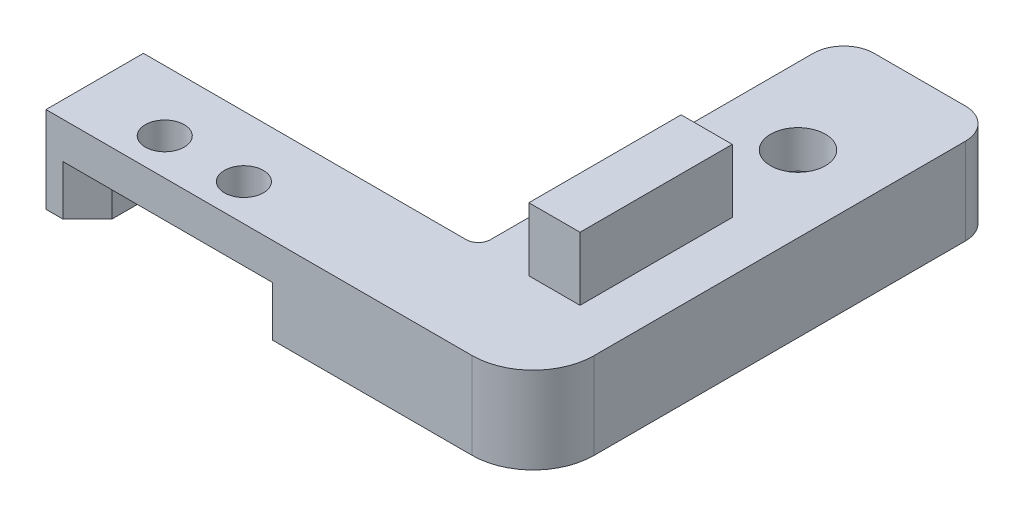
ISO-10303-21;
HEADER;
FILE_DESCRIPTION(('STEP AP214'),'2;1');
FILE_NAME('part.step','',(''),(''),'','','');
FILE_SCHEMA(('AUTOMOTIVE_DESIGN { 1 0 10303 214 1 1 1 1 }'));
ENDSEC;
DATA;
#1=APPLICATION_CONTEXT('core data for automotive mechanical design processes');
#2=APPLICATION_PROTOCOL_DEFINITION('international standard','automotive_design',2000,#1);
#3=PRODUCT_CONTEXT('',#1,'mechanical');
#4=PRODUCT('Part','Part','',(#3));
#5=PRODUCT_RELATED_PRODUCT_CATEGORY('part','',(#4));
#6=PRODUCT_DEFINITION_FORMATION('','',#4);
#7=PRODUCT_DEFINITION_CONTEXT('part definition',#1,'design');
#8=PRODUCT_DEFINITION('design','',#6,#7);
#9=PRODUCT_DEFINITION_SHAPE('','',#8);
#10=(LENGTH_UNIT() NAMED_UNIT(*) SI_UNIT(.MILLI.,.METRE.));
#11=(NAMED_UNIT(*) PLANE_ANGLE_UNIT() SI_UNIT($,.RADIAN.));
#12=(NAMED_UNIT(*) SI_UNIT($,.STERADIAN.) SOLID_ANGLE_UNIT());
#13=UNCERTAINTY_MEASURE_WITH_UNIT(LENGTH_MEASURE(1.E-05),#10,'distance_accuracy_value','');
#14=(GEOMETRIC_REPRESENTATION_CONTEXT(3) GLOBAL_UNCERTAINTY_ASSIGNED_CONTEXT((#13)) GLOBAL_UNIT_ASSIGNED_CONTEXT((#10,
#11,#12)) REPRESENTATION_CONTEXT('',''));
#15=CARTESIAN_POINT('',(0.,0.,0.));
#16=DIRECTION('',(0.,0.,1.));
#17=DIRECTION('',(1.,0.,0.));
#18=AXIS2_PLACEMENT_3D('',#15,#16,#17);
#19=CARTESIAN_POINT('',(0.,0.,0.));
#20=DIRECTION('',(0.,-1.,0.));
#21=DIRECTION('',(0.,0.,-1.));
#22=AXIS2_PLACEMENT_3D('',#19,#20,#21);
#23=PLANE('',#22);
#24=DIRECTION('',(1.,0.,0.));
#25=VECTOR('',#24,1.);
#26=CARTESIAN_POINT('',(0.,0.,38.));
#27=LINE('',#26,#25);
#28=CARTESIAN_POINT('',(-21.4,0.,38.));
#29=VERTEX_POINT('',#28);
#30=CARTESIAN_POINT('',(-4.99999999999999,0.,38.));
#31=VERTEX_POINT('',#30);
#32=EDGE_CURVE('E301',#29,#31,#27,.T.);
#33=ORIENTED_EDGE('',*,*,#32,.F.);
#34=DIRECTION('',(0.707106781186546,0.,0.707106781186549));
#35=VECTOR('',#34,1.);
#36=CARTESIAN_POINT('',(-29.7,0.,29.6999999999999));
#37=LINE('',#36,#35);
#38=CARTESIAN_POINT('',(-23.4,0.,36.));
#39=VERTEX_POINT('',#38);
#40=EDGE_CURVE('E67',#29,#39,#37,.F.);
#41=ORIENTED_EDGE('',*,*,#40,.T.);
#42=DIRECTION('',(0.,0.,1.));
#43=VECTOR('',#42,1.);
#44=CARTESIAN_POINT('',(-23.4,0.,30.));
#45=LINE('',#44,#43);
#46=CARTESIAN_POINT('',(-23.4,0.,30.));
#47=VERTEX_POINT('',#46);
#48=EDGE_CURVE('E210',#47,#39,#45,.T.);
#49=ORIENTED_EDGE('',*,*,#48,.F.);
#50=DIRECTION('',(-1.,0.,0.));
#51=VECTOR('',#50,1.);
#52=CARTESIAN_POINT('',(-12.5,0.,30.));
#53=LINE('',#52,#51);
#54=CARTESIAN_POINT('',(-13.5,0.,30.));
#55=VERTEX_POINT('',#54);
#56=EDGE_CURVE('E296',#55,#47,#53,.T.);
#57=ORIENTED_EDGE('',*,*,#56,.F.);
#58=CARTESIAN_POINT('',(-13.5,0.,29.));
#59=DIRECTION('',(0.,-1.,0.));
#60=DIRECTION('',(0.,0.,-1.));
#61=AXIS2_PLACEMENT_3D('',#58,#59,#60);
#62=CIRCLE('',#61,1.);
#63=CARTESIAN_POINT('',(-12.5,0.,29.));
#64=VERTEX_POINT('',#63);
#65=EDGE_CURVE('E346',#55,#64,#62,.F.);
#66=ORIENTED_EDGE('',*,*,#65,.T.);
#67=DIRECTION('',(0.,0.,1.));
#68=VECTOR('',#67,1.);
#69=CARTESIAN_POINT('',(-12.5,0.,0.));
#70=LINE('',#69,#68);
#71=CARTESIAN_POINT('',(-12.5,0.,2.5));
#72=VERTEX_POINT('',#71);
#73=EDGE_CURVE('E292',#72,#64,#70,.T.);
#74=ORIENTED_EDGE('',*,*,#73,.F.);
#75=CARTESIAN_POINT('',(-10.,0.,2.5));
#76=DIRECTION('',(0.,-1.,0.));
#77=DIRECTION('',(0.,0.,-1.));
#78=AXIS2_PLACEMENT_3D('',#75,#76,#77);
#79=CIRCLE('',#78,2.5);
#80=CARTESIAN_POINT('',(-10.,0.,0.));
#81=VERTEX_POINT('',#80);
#82=EDGE_CURVE('E328',#72,#81,#79,.T.);
#83=ORIENTED_EDGE('',*,*,#82,.T.);
#84=DIRECTION('',(-1.,0.,0.));
#85=VECTOR('',#84,1.);
#86=CARTESIAN_POINT('',(0.,0.,0.));
#87=LINE('',#86,#85);
#88=CARTESIAN_POINT('',(-2.5,0.,0.));
#89=VERTEX_POINT('',#88);
#90=EDGE_CURVE('E289',#89,#81,#87,.T.);
#91=ORIENTED_EDGE('',*,*,#90,.F.);
#92=CARTESIAN_POINT('',(-2.5,0.,2.5));
#93=DIRECTION('',(0.,-1.,0.));
#94=DIRECTION('',(0.,0.,-1.));
#95=AXIS2_PLACEMENT_3D('',#92,#93,#94);
#96=CIRCLE('',#95,2.5);
#97=CARTESIAN_POINT('',(0.,0.,2.5));
#98=VERTEX_POINT('',#97);
#99=EDGE_CURVE('E326',#89,#98,#96,.T.);
#100=ORIENTED_EDGE('',*,*,#99,.T.);
#101=DIRECTION('',(0.,0.,-1.));
#102=VECTOR('',#101,1.);
#103=CARTESIAN_POINT('',(0.,0.,0.));
#104=LINE('',#103,#102);
#105=CARTESIAN_POINT('',(0.,0.,33.));
#106=VERTEX_POINT('',#105);
#107=EDGE_CURVE('E268',#106,#98,#104,.T.);
#108=ORIENTED_EDGE('',*,*,#107,.F.);
#109=CARTESIAN_POINT('',(-5.,0.,33.));
#110=DIRECTION('',(0.,-1.,0.));
#111=DIRECTION('',(0.,0.,-1.));
#112=AXIS2_PLACEMENT_3D('',#109,#110,#111);
#113=CIRCLE('',#112,5.);
#114=EDGE_CURVE('E316',#106,#31,#113,.T.);
#115=ORIENTED_EDGE('',*,*,#114,.T.);
#116=EDGE_LOOP('',(#33,#41,#49,#57,#66,#74,#83,#91,#100,#108,#115));
#117=FACE_BOUND('',#116,.T.);
#118=CARTESIAN_POINT('',(-6.25,0.,10.));
#119=DIRECTION('',(0.,-1.,0.));
#120=DIRECTION('',(0.,0.,-1.));
#121=AXIS2_PLACEMENT_3D('',#118,#119,#120);
#122=CIRCLE('',#121,4.);
#123=CARTESIAN_POINT('',(-6.25,0.,6.));
#124=VERTEX_POINT('',#123);
#125=EDGE_CURVE('E225',#124,#124,#122,.T.);
#126=ORIENTED_EDGE('',*,*,#125,.F.);
#127=EDGE_LOOP('',(#126));
#128=FACE_BOUND('',#127,.T.);
#129=ADVANCED_FACE('F43',(#117,#128),#23,.T.);
#130=CARTESIAN_POINT('',(-33.25,0.,35.));
#131=DIRECTION('',(0.,-1.,0.));
#132=DIRECTION('',(0.,0.,-1.));
#133=AXIS2_PLACEMENT_3D('',#130,#131,#132);
#134=CYLINDRICAL_SURFACE('',#133,1.6);
#135=CARTESIAN_POINT('',(-33.25,7.1,35.));
#136=DIRECTION('',(0.,-1.,0.));
#137=DIRECTION('',(0.,0.,-1.));
#138=AXIS2_PLACEMENT_3D('',#135,#136,#137);
#139=CIRCLE('',#138,1.6);
#140=CARTESIAN_POINT('',(-33.25,7.1,33.4));
#141=VERTEX_POINT('',#140);
#142=EDGE_CURVE('E222',#141,#141,#139,.T.);
#143=ORIENTED_EDGE('',*,*,#142,.F.);
#144=EDGE_LOOP('',(#143));
#145=FACE_BOUND('',#144,.T.);
#146=CARTESIAN_POINT('',(-33.25,4.1,35.));
#147=DIRECTION('',(0.,-1.,0.));
#148=DIRECTION('',(0.,0.,-1.));
#149=AXIS2_PLACEMENT_3D('',#146,#147,#148);
#150=CIRCLE('',#149,1.6);
#151=CARTESIAN_POINT('',(-33.25,4.1,33.4));
#152=VERTEX_POINT('',#151);
#153=EDGE_CURVE('E216',#152,#152,#150,.F.);
#154=ORIENTED_EDGE('',*,*,#153,.F.);
#155=EDGE_LOOP('',(#154));
#156=FACE_BOUND('',#155,.T.);
#157=ADVANCED_FACE('F428',(#145,#156),#134,.F.);
#158=CARTESIAN_POINT('',(-26.75,0.,35.));
#159=DIRECTION('',(0.,-1.,0.));
#160=DIRECTION('',(0.,0.,-1.));
#161=AXIS2_PLACEMENT_3D('',#158,#159,#160);
#162=CYLINDRICAL_SURFACE('',#161,1.6);
#163=CARTESIAN_POINT('',(-26.75,7.1,35.));
#164=DIRECTION('',(0.,-1.,0.));
#165=DIRECTION('',(0.,0.,-1.));
#166=AXIS2_PLACEMENT_3D('',#163,#164,#165);
#167=CIRCLE('',#166,1.6);
#168=CARTESIAN_POINT('',(-26.75,7.1,33.4));
#169=VERTEX_POINT('',#168);
#170=EDGE_CURVE('E219',#169,#169,#167,.T.);
#171=ORIENTED_EDGE('',*,*,#170,.F.);
#172=EDGE_LOOP('',(#171));
#173=FACE_BOUND('',#172,.T.);
#174=CARTESIAN_POINT('',(-26.75,4.1,35.));
#175=DIRECTION('',(0.,-1.,0.));
#176=DIRECTION('',(0.,0.,-1.));
#177=AXIS2_PLACEMENT_3D('',#174,#175,#176);
#178=CIRCLE('',#177,1.6);
#179=CARTESIAN_POINT('',(-26.75,4.1,33.4));
#180=VERTEX_POINT('',#179);
#181=EDGE_CURVE('E214',#180,#180,#178,.F.);
#182=ORIENTED_EDGE('',*,*,#181,.F.);
#183=EDGE_LOOP('',(#182));
#184=FACE_BOUND('',#183,.T.);
#185=ADVANCED_FACE('F435',(#173,#184),#162,.F.);
#186=CARTESIAN_POINT('',(0.,7.1,0.));
#187=DIRECTION('',(0.,-1.,0.));
#188=DIRECTION('',(0.,0.,-1.));
#189=AXIS2_PLACEMENT_3D('',#186,#187,#188);
#190=PLANE('',#189);
#191=ORIENTED_EDGE('',*,*,#170,.T.);
#192=EDGE_LOOP('',(#191));
#193=FACE_BOUND('',#192,.T.);
#194=ORIENTED_EDGE('',*,*,#142,.T.);
#195=EDGE_LOOP('',(#194));
#196=FACE_BOUND('',#195,.T.);
#197=CARTESIAN_POINT('',(-6.25,7.1,10.));
#198=DIRECTION('',(0.,-1.,0.));
#199=DIRECTION('',(0.,0.,-1.));
#200=AXIS2_PLACEMENT_3D('',#197,#198,#199);
#201=CIRCLE('',#200,2.25);
#202=CARTESIAN_POINT('',(-6.25,7.1,7.75));
#203=VERTEX_POINT('',#202);
#204=EDGE_CURVE('E234',#203,#203,#201,.T.);
#205=ORIENTED_EDGE('',*,*,#204,.T.);
#206=EDGE_LOOP('',(#205));
#207=FACE_BOUND('',#206,.T.);
#208=DIRECTION('',(-1.,0.,0.));
#209=VECTOR('',#208,1.);
#210=CARTESIAN_POINT('',(0.,7.1,0.));
#211=LINE('',#210,#209);
#212=CARTESIAN_POINT('',(-2.5,7.1,0.));
#213=VERTEX_POINT('',#212);
#214=CARTESIAN_POINT('',(-10.,7.1,0.));
#215=VERTEX_POINT('',#214);
#216=EDGE_CURVE('E272',#213,#215,#211,.T.);
#217=ORIENTED_EDGE('',*,*,#216,.T.);
#218=CARTESIAN_POINT('',(-10.,7.1,2.5));
#219=DIRECTION('',(0.,-1.,0.));
#220=DIRECTION('',(0.,0.,-1.));
#221=AXIS2_PLACEMENT_3D('',#218,#219,#220);
#222=CIRCLE('',#221,2.5);
#223=CARTESIAN_POINT('',(-12.5,7.1,2.5));
#224=VERTEX_POINT('',#223);
#225=EDGE_CURVE('E337',#215,#224,#222,.F.);
#226=ORIENTED_EDGE('',*,*,#225,.T.);
#227=DIRECTION('',(0.,0.,1.));
#228=VECTOR('',#227,1.);
#229=CARTESIAN_POINT('',(-12.5,7.1,0.));
#230=LINE('',#229,#228);
#231=CARTESIAN_POINT('',(-12.5,7.1,29.));
#232=VERTEX_POINT('',#231);
#233=EDGE_CURVE('E276',#224,#232,#230,.T.);
#234=ORIENTED_EDGE('',*,*,#233,.T.);
#235=CARTESIAN_POINT('',(-13.5,7.1,29.));
#236=DIRECTION('',(0.,-1.,0.));
#237=DIRECTION('',(0.,0.,-1.));
#238=AXIS2_PLACEMENT_3D('',#235,#236,#237);
#239=CIRCLE('',#238,1.);
#240=CARTESIAN_POINT('',(-13.5,7.1,30.));
#241=VERTEX_POINT('',#240);
#242=EDGE_CURVE('E348',#232,#241,#239,.T.);
#243=ORIENTED_EDGE('',*,*,#242,.T.);
#244=DIRECTION('',(-1.,0.,0.));
#245=VECTOR('',#244,1.);
#246=CARTESIAN_POINT('',(-12.5,7.1,30.));
#247=LINE('',#246,#245);
#248=CARTESIAN_POINT('',(-40.,7.1,30.));
#249=VERTEX_POINT('',#248);
#250=EDGE_CURVE('E279',#241,#249,#247,.T.);
#251=ORIENTED_EDGE('',*,*,#250,.T.);
#252=DIRECTION('',(0.,0.,1.));
#253=VECTOR('',#252,1.);
#254=CARTESIAN_POINT('',(-40.,7.1,38.));
#255=LINE('',#254,#253);
#256=CARTESIAN_POINT('',(-40.,7.1,38.));
#257=VERTEX_POINT('',#256);
#258=EDGE_CURVE('E281',#249,#257,#255,.T.);
#259=ORIENTED_EDGE('',*,*,#258,.T.);
#260=DIRECTION('',(1.,0.,0.));
#261=VECTOR('',#260,1.);
#262=CARTESIAN_POINT('',(-12.5,7.1,38.));
#263=LINE('',#262,#261);
#264=CARTESIAN_POINT('',(-4.99999999999999,7.1,38.));
#265=VERTEX_POINT('',#264);
#266=EDGE_CURVE('E283',#257,#265,#263,.T.);
#267=ORIENTED_EDGE('',*,*,#266,.T.);
#268=CARTESIAN_POINT('',(-5.,7.1,33.));
#269=DIRECTION('',(0.,-1.,0.));
#270=DIRECTION('',(0.,0.,-1.));
#271=AXIS2_PLACEMENT_3D('',#268,#269,#270);
#272=CIRCLE('',#271,5.);
#273=CARTESIAN_POINT('',(0.,7.1,33.));
#274=VERTEX_POINT('',#273);
#275=EDGE_CURVE('E321',#265,#274,#272,.F.);
#276=ORIENTED_EDGE('',*,*,#275,.T.);
#277=DIRECTION('',(0.,0.,-1.));
#278=VECTOR('',#277,1.);
#279=CARTESIAN_POINT('',(0.,7.1,0.));
#280=LINE('',#279,#278);
#281=CARTESIAN_POINT('',(0.,7.1,2.5));
#282=VERTEX_POINT('',#281);
#283=EDGE_CURVE('E269',#274,#282,#280,.T.);
#284=ORIENTED_EDGE('',*,*,#283,.T.);
#285=CARTESIAN_POINT('',(-2.5,7.1,2.5));
#286=DIRECTION('',(0.,-1.,0.));
#287=DIRECTION('',(0.,0.,-1.));
#288=AXIS2_PLACEMENT_3D('',#285,#286,#287);
#289=CIRCLE('',#288,2.5);
#290=EDGE_CURVE('E335',#282,#213,#289,.F.);
#291=ORIENTED_EDGE('',*,*,#290,.T.);
#292=EDGE_LOOP('',(#217,#226,#234,#243,#251,#259,#267,#276,#284,#291));
#293=FACE_BOUND('',#292,.T.);
#294=DIRECTION('',(0.,0.,1.));
#295=VECTOR('',#294,1.);
#296=CARTESIAN_POINT('',(-8.35,7.1,17.5));
#297=LINE('',#296,#295);
#298=CARTESIAN_POINT('',(-8.35,7.1,17.5));
#299=VERTEX_POINT('',#298);
#300=CARTESIAN_POINT('',(-8.35,7.1,30.));
#301=VERTEX_POINT('',#300);
#302=EDGE_CURVE('E246',#299,#301,#297,.T.);
#303=ORIENTED_EDGE('',*,*,#302,.F.);
#304=DIRECTION('',(-1.,0.,0.));
#305=VECTOR('',#304,1.);
#306=CARTESIAN_POINT('',(-8.35,7.1,17.5));
#307=LINE('',#306,#305);
#308=CARTESIAN_POINT('',(-4.15,7.1,17.5));
#309=VERTEX_POINT('',#308);
#310=EDGE_CURVE('E239',#309,#299,#307,.T.);
#311=ORIENTED_EDGE('',*,*,#310,.F.);
#312=DIRECTION('',(0.,0.,-1.));
#313=VECTOR('',#312,1.);
#314=CARTESIAN_POINT('',(-4.15,7.1,17.5));
#315=LINE('',#314,#313);
#316=CARTESIAN_POINT('',(-4.15,7.1,30.));
#317=VERTEX_POINT('',#316);
#318=EDGE_CURVE('E252',#317,#309,#315,.T.);
#319=ORIENTED_EDGE('',*,*,#318,.F.);
#320=DIRECTION('',(1.,0.,0.));
#321=VECTOR('',#320,1.);
#322=CARTESIAN_POINT('',(-8.35,7.1,30.));
#323=LINE('',#322,#321);
#324=EDGE_CURVE('E249',#301,#317,#323,.T.);
#325=ORIENTED_EDGE('',*,*,#324,.F.);
#326=EDGE_LOOP('',(#303,#311,#319,#325));
#327=FACE_BOUND('',#326,.T.);
#328=ADVANCED_FACE('F376',(#193,#196,#207,#293,#327),#190,.F.);
#329=CARTESIAN_POINT('',(0.,7.1,0.));
#330=DIRECTION('',(-1.,0.,0.));
#331=DIRECTION('',(0.,0.,1.));
#332=AXIS2_PLACEMENT_3D('',#329,#330,#331);
#333=PLANE('',#332);
#334=ORIENTED_EDGE('',*,*,#107,.T.);
#335=DIRECTION('',(0.,-1.,0.));
#336=VECTOR('',#335,1.);
#337=CARTESIAN_POINT('',(0.,7.1,2.5));
#338=LINE('',#337,#336);
#339=EDGE_CURVE('E339',#98,#282,#338,.F.);
#340=ORIENTED_EDGE('',*,*,#339,.T.);
#341=ORIENTED_EDGE('',*,*,#283,.F.);
#342=DIRECTION('',(0.,-1.,0.));
#343=VECTOR('',#342,1.);
#344=CARTESIAN_POINT('',(0.,7.1,33.));
#345=LINE('',#344,#343);
#346=EDGE_CURVE('E309',#274,#106,#345,.T.);
#347=ORIENTED_EDGE('',*,*,#346,.T.);
#348=EDGE_LOOP('',(#334,#340,#341,#347));
#349=FACE_BOUND('',#348,.T.);
#350=ADVANCED_FACE('F406',(#349),#333,.F.);
#351=CARTESIAN_POINT('',(0.,7.1,0.));
#352=DIRECTION('',(0.,0.,1.));
#353=DIRECTION('',(1.,0.,0.));
#354=AXIS2_PLACEMENT_3D('',#351,#352,#353);
#355=PLANE('',#354);
#356=ORIENTED_EDGE('',*,*,#90,.T.);
#357=DIRECTION('',(0.,-1.,0.));
#358=VECTOR('',#357,1.);
#359=CARTESIAN_POINT('',(-10.,7.1,0.));
#360=LINE('',#359,#358);
#361=EDGE_CURVE('E333',#81,#215,#360,.F.);
#362=ORIENTED_EDGE('',*,*,#361,.T.);
#363=ORIENTED_EDGE('',*,*,#216,.F.);
#364=DIRECTION('',(0.,-1.,0.));
#365=VECTOR('',#364,1.);
#366=CARTESIAN_POINT('',(-2.5,7.1,0.));
#367=LINE('',#366,#365);
#368=EDGE_CURVE('E330',#213,#89,#367,.T.);
#369=ORIENTED_EDGE('',*,*,#368,.T.);
#370=EDGE_LOOP('',(#356,#362,#363,#369));
#371=FACE_BOUND('',#370,.T.);
#372=ADVANCED_FACE('F397',(#371),#355,.F.);
#373=CARTESIAN_POINT('',(-12.5,7.1,0.));
#374=DIRECTION('',(1.,0.,0.));
#375=DIRECTION('',(0.,0.,-1.));
#376=AXIS2_PLACEMENT_3D('',#373,#374,#375);
#377=PLANE('',#376);
#378=ORIENTED_EDGE('',*,*,#73,.T.);
#379=DIRECTION('',(0.,-1.,0.));
#380=VECTOR('',#379,1.);
#381=CARTESIAN_POINT('',(-12.5,7.1,29.));
#382=LINE('',#381,#380);
#383=EDGE_CURVE('E344',#64,#232,#382,.F.);
#384=ORIENTED_EDGE('',*,*,#383,.T.);
#385=ORIENTED_EDGE('',*,*,#233,.F.);
#386=DIRECTION('',(0.,-1.,0.));
#387=VECTOR('',#386,1.);
#388=CARTESIAN_POINT('',(-12.5,7.1,2.5));
#389=LINE('',#388,#387);
#390=EDGE_CURVE('E323',#224,#72,#389,.T.);
#391=ORIENTED_EDGE('',*,*,#390,.T.);
#392=EDGE_LOOP('',(#378,#384,#385,#391));
#393=FACE_BOUND('',#392,.T.);
#394=ADVANCED_FACE('F388',(#393),#377,.F.);
#395=CARTESIAN_POINT('',(-12.5,7.1,30.));
#396=DIRECTION('',(0.,0.,1.));
#397=DIRECTION('',(1.,0.,0.));
#398=AXIS2_PLACEMENT_3D('',#395,#396,#397);
#399=PLANE('',#398);
#400=ORIENTED_EDGE('',*,*,#250,.F.);
#401=DIRECTION('',(0.,-1.,0.));
#402=VECTOR('',#401,1.);
#403=CARTESIAN_POINT('',(-13.5,0.,30.));
#404=LINE('',#403,#402);
#405=EDGE_CURVE('E341',#241,#55,#404,.T.);
#406=ORIENTED_EDGE('',*,*,#405,.T.);
#407=ORIENTED_EDGE('',*,*,#56,.T.);
#408=DIRECTION('',(0.,-1.,0.));
#409=VECTOR('',#408,1.);
#410=CARTESIAN_POINT('',(-23.4,4.1,30.));
#411=LINE('',#410,#409);
#412=CARTESIAN_POINT('',(-23.4,4.1,30.));
#413=VERTEX_POINT('',#412);
#414=EDGE_CURVE('E202',#413,#47,#411,.T.);
#415=ORIENTED_EDGE('',*,*,#414,.F.);
#416=DIRECTION('',(1.,0.,0.));
#417=VECTOR('',#416,1.);
#418=CARTESIAN_POINT('',(-23.4,4.1,30.));
#419=LINE('',#418,#417);
#420=CARTESIAN_POINT('',(-36.6,4.1,30.));
#421=VERTEX_POINT('',#420);
#422=EDGE_CURVE('E187',#421,#413,#419,.T.);
#423=ORIENTED_EDGE('',*,*,#422,.F.);
#424=DIRECTION('',(0.,-1.,0.));
#425=VECTOR('',#424,1.);
#426=CARTESIAN_POINT('',(-36.6,4.1,30.));
#427=LINE('',#426,#425);
#428=CARTESIAN_POINT('',(-36.6,0.,30.));
#429=VERTEX_POINT('',#428);
#430=EDGE_CURVE('E196',#421,#429,#427,.T.);
#431=ORIENTED_EDGE('',*,*,#430,.T.);
#432=CARTESIAN_POINT('',(-40.,0.,30.));
#433=VERTEX_POINT('',#432);
#434=EDGE_CURVE('E295',#429,#433,#53,.T.);
#435=ORIENTED_EDGE('',*,*,#434,.T.);
#436=DIRECTION('',(0.,-1.,0.));
#437=VECTOR('',#436,1.);
#438=CARTESIAN_POINT('',(-40.,7.1,30.));
#439=LINE('',#438,#437);
#440=EDGE_CURVE('E306',#249,#433,#439,.T.);
#441=ORIENTED_EDGE('',*,*,#440,.F.);
#442=EDGE_LOOP('',(#400,#406,#407,#415,#423,#431,#435,#441));
#443=FACE_BOUND('',#442,.T.);
#444=ADVANCED_FACE('F205',(#443),#399,.F.);
#445=CARTESIAN_POINT('',(-40.,7.1,38.));
#446=DIRECTION('',(1.,0.,0.));
#447=DIRECTION('',(0.,0.,-1.));
#448=AXIS2_PLACEMENT_3D('',#445,#446,#447);
#449=PLANE('',#448);
#450=DIRECTION('',(0.,0.,1.));
#451=VECTOR('',#450,1.);
#452=CARTESIAN_POINT('',(-40.,0.,38.));
#453=LINE('',#452,#451);
#454=CARTESIAN_POINT('',(-40.,0.,38.));
#455=VERTEX_POINT('',#454);
#456=EDGE_CURVE('E298',#433,#455,#453,.T.);
#457=ORIENTED_EDGE('',*,*,#456,.T.);
#458=DIRECTION('',(0.,-1.,0.));
#459=VECTOR('',#458,1.);
#460=CARTESIAN_POINT('',(-40.,7.1,38.));
#461=LINE('',#460,#459);
#462=EDGE_CURVE('E286',#257,#455,#461,.T.);
#463=ORIENTED_EDGE('',*,*,#462,.F.);
#464=ORIENTED_EDGE('',*,*,#258,.F.);
#465=ORIENTED_EDGE('',*,*,#440,.T.);
#466=EDGE_LOOP('',(#457,#463,#464,#465));
#467=FACE_BOUND('',#466,.T.);
#468=ADVANCED_FACE('F372',(#467),#449,.F.);
#469=CARTESIAN_POINT('',(0.,7.1,38.));
#470=DIRECTION('',(0.,0.,-1.));
#471=DIRECTION('',(-1.,0.,0.));
#472=AXIS2_PLACEMENT_3D('',#469,#470,#471);
#473=PLANE('',#472);
#474=CARTESIAN_POINT('',(-38.6,0.,38.));
#475=VERTEX_POINT('',#474);
#476=EDGE_CURVE('E273',#455,#475,#27,.T.);
#477=ORIENTED_EDGE('',*,*,#476,.T.);
#478=DIRECTION('',(0.,1.,0.));
#479=VECTOR('',#478,1.);
#480=CARTESIAN_POINT('',(-38.6,7.1,38.));
#481=LINE('',#480,#479);
#482=CARTESIAN_POINT('',(-38.6,4.1,38.));
#483=VERTEX_POINT('',#482);
#484=EDGE_CURVE('E357',#475,#483,#481,.T.);
#485=ORIENTED_EDGE('',*,*,#484,.T.);
#486=DIRECTION('',(-1.,0.,0.));
#487=VECTOR('',#486,1.);
#488=CARTESIAN_POINT('',(-23.4,4.1,38.));
#489=LINE('',#488,#487);
#490=CARTESIAN_POINT('',(-21.4,4.1,38.));
#491=VERTEX_POINT('',#490);
#492=EDGE_CURVE('E193',#491,#483,#489,.T.);
#493=ORIENTED_EDGE('',*,*,#492,.F.);
#494=DIRECTION('',(0.,-1.,0.));
#495=VECTOR('',#494,1.);
#496=CARTESIAN_POINT('',(-21.4,7.1,38.));
#497=LINE('',#496,#495);
#498=EDGE_CURVE('E354',#491,#29,#497,.T.);
#499=ORIENTED_EDGE('',*,*,#498,.T.);
#500=ORIENTED_EDGE('',*,*,#32,.T.);
#501=DIRECTION('',(0.,-1.,0.));
#502=VECTOR('',#501,1.);
#503=CARTESIAN_POINT('',(-4.99999999999999,7.1,38.));
#504=LINE('',#503,#502);
#505=EDGE_CURVE('E319',#31,#265,#504,.F.);
#506=ORIENTED_EDGE('',*,*,#505,.T.);
#507=ORIENTED_EDGE('',*,*,#266,.F.);
#508=ORIENTED_EDGE('',*,*,#462,.T.);
#509=EDGE_LOOP('',(#477,#485,#493,#499,#500,#506,#507,#508));
#510=FACE_BOUND('',#509,.T.);
#511=ADVANCED_FACE('F363',(#510),#473,.F.);
#512=DIRECTION('',(0.,0.,-1.));
#513=VECTOR('',#512,1.);
#514=CARTESIAN_POINT('',(-36.6,0.,30.));
#515=LINE('',#514,#513);
#516=CARTESIAN_POINT('',(-36.6,0.,36.));
#517=VERTEX_POINT('',#516);
#518=EDGE_CURVE('E199',#517,#429,#515,.T.);
#519=ORIENTED_EDGE('',*,*,#518,.F.);
#520=DIRECTION('',(0.707106781186549,0.,-0.707106781186546));
#521=VECTOR('',#520,1.);
#522=CARTESIAN_POINT('',(-0.299999999999941,0.,-0.299999999999942));
#523=LINE('',#522,#521);
#524=EDGE_CURVE('E352',#517,#475,#523,.F.);
#525=ORIENTED_EDGE('',*,*,#524,.T.);
#526=ORIENTED_EDGE('',*,*,#476,.F.);
#527=ORIENTED_EDGE('',*,*,#456,.F.);
#528=ORIENTED_EDGE('',*,*,#434,.F.);
#529=EDGE_LOOP('',(#519,#525,#526,#527,#528));
#530=FACE_BOUND('',#529,.T.);
#531=ADVANCED_FACE('F367',(#530),#23,.T.);
#532=CARTESIAN_POINT('',(-8.35,12.3,17.5));
#533=DIRECTION('',(1.,0.,0.));
#534=DIRECTION('',(0.,0.,-1.));
#535=AXIS2_PLACEMENT_3D('',#532,#533,#534);
#536=PLANE('',#535);
#537=ORIENTED_EDGE('',*,*,#302,.T.);
#538=DIRECTION('',(0.,-1.,0.));
#539=VECTOR('',#538,1.);
#540=CARTESIAN_POINT('',(-8.35,12.3,30.));
#541=LINE('',#540,#539);
#542=CARTESIAN_POINT('',(-8.35,12.3,30.));
#543=VERTEX_POINT('',#542);
#544=EDGE_CURVE('E265',#543,#301,#541,.T.);
#545=ORIENTED_EDGE('',*,*,#544,.F.);
#546=DIRECTION('',(0.,0.,1.));
#547=VECTOR('',#546,1.);
#548=CARTESIAN_POINT('',(-8.35,12.3,17.5));
#549=LINE('',#548,#547);
#550=CARTESIAN_POINT('',(-8.35,12.3,17.5));
#551=VERTEX_POINT('',#550);
#552=EDGE_CURVE('E235',#551,#543,#549,.T.);
#553=ORIENTED_EDGE('',*,*,#552,.F.);
#554=DIRECTION('',(0.,-1.,0.));
#555=VECTOR('',#554,1.);
#556=CARTESIAN_POINT('',(-8.35,12.3,17.5));
#557=LINE('',#556,#555);
#558=EDGE_CURVE('E245',#551,#299,#557,.T.);
#559=ORIENTED_EDGE('',*,*,#558,.T.);
#560=EDGE_LOOP('',(#537,#545,#553,#559));
#561=FACE_BOUND('',#560,.T.);
#562=ADVANCED_FACE('F441',(#561),#536,.F.);
#563=CARTESIAN_POINT('',(-8.35,12.3,30.));
#564=DIRECTION('',(0.,0.,-1.));
#565=DIRECTION('',(-1.,0.,0.));
#566=AXIS2_PLACEMENT_3D('',#563,#564,#565);
#567=PLANE('',#566);
#568=ORIENTED_EDGE('',*,*,#324,.T.);
#569=DIRECTION('',(0.,-1.,0.));
#570=VECTOR('',#569,1.);
#571=CARTESIAN_POINT('',(-4.15,12.3,30.));
#572=LINE('',#571,#570);
#573=CARTESIAN_POINT('',(-4.15,12.3,30.));
#574=VERTEX_POINT('',#573);
#575=EDGE_CURVE('E262',#574,#317,#572,.T.);
#576=ORIENTED_EDGE('',*,*,#575,.F.);
#577=DIRECTION('',(1.,0.,0.));
#578=VECTOR('',#577,1.);
#579=CARTESIAN_POINT('',(-8.35,12.3,30.));
#580=LINE('',#579,#578);
#581=EDGE_CURVE('E238',#543,#574,#580,.T.);
#582=ORIENTED_EDGE('',*,*,#581,.F.);
#583=ORIENTED_EDGE('',*,*,#544,.T.);
#584=EDGE_LOOP('',(#568,#576,#582,#583));
#585=FACE_BOUND('',#584,.T.);
#586=ADVANCED_FACE('F445',(#585),#567,.F.);
#587=CARTESIAN_POINT('',(-4.15,12.3,17.5));
#588=DIRECTION('',(-1.,0.,0.));
#589=DIRECTION('',(0.,0.,1.));
#590=AXIS2_PLACEMENT_3D('',#587,#588,#589);
#591=PLANE('',#590);
#592=ORIENTED_EDGE('',*,*,#318,.T.);
#593=DIRECTION('',(0.,-1.,0.));
#594=VECTOR('',#593,1.);
#595=CARTESIAN_POINT('',(-4.15,12.3,17.5));
#596=LINE('',#595,#594);
#597=CARTESIAN_POINT('',(-4.15,12.3,17.5));
#598=VERTEX_POINT('',#597);
#599=EDGE_CURVE('E259',#598,#309,#596,.T.);
#600=ORIENTED_EDGE('',*,*,#599,.F.);
#601=DIRECTION('',(0.,0.,-1.));
#602=VECTOR('',#601,1.);
#603=CARTESIAN_POINT('',(-4.15,12.3,17.5));
#604=LINE('',#603,#602);
#605=EDGE_CURVE('E241',#574,#598,#604,.T.);
#606=ORIENTED_EDGE('',*,*,#605,.F.);
#607=ORIENTED_EDGE('',*,*,#575,.T.);
#608=EDGE_LOOP('',(#592,#600,#606,#607));
#609=FACE_BOUND('',#608,.T.);
#610=ADVANCED_FACE('F587',(#609),#591,.F.);
#611=CARTESIAN_POINT('',(-8.35,12.3,17.5));
#612=DIRECTION('',(0.,0.,1.));
#613=DIRECTION('',(1.,0.,0.));
#614=AXIS2_PLACEMENT_3D('',#611,#612,#613);
#615=PLANE('',#614);
#616=ORIENTED_EDGE('',*,*,#310,.T.);
#617=ORIENTED_EDGE('',*,*,#558,.F.);
#618=DIRECTION('',(-1.,0.,0.));
#619=VECTOR('',#618,1.);
#620=CARTESIAN_POINT('',(-8.35,12.3,17.5));
#621=LINE('',#620,#619);
#622=EDGE_CURVE('E243',#598,#551,#621,.T.);
#623=ORIENTED_EDGE('',*,*,#622,.F.);
#624=ORIENTED_EDGE('',*,*,#599,.T.);
#625=EDGE_LOOP('',(#616,#617,#623,#624));
#626=FACE_BOUND('',#625,.T.);
#627=ADVANCED_FACE('F577',(#626),#615,.F.);
#628=CARTESIAN_POINT('',(0.,12.3,0.));
#629=DIRECTION('',(0.,1.,0.));
#630=DIRECTION('',(0.,0.,1.));
#631=AXIS2_PLACEMENT_3D('',#628,#629,#630);
#632=PLANE('',#631);
#633=ORIENTED_EDGE('',*,*,#552,.T.);
#634=ORIENTED_EDGE('',*,*,#581,.T.);
#635=ORIENTED_EDGE('',*,*,#605,.T.);
#636=ORIENTED_EDGE('',*,*,#622,.T.);
#637=EDGE_LOOP('',(#633,#634,#635,#636));
#638=FACE_BOUND('',#637,.T.);
#639=ADVANCED_FACE('F567',(#638),#632,.T.);
#640=CARTESIAN_POINT('',(-6.25,0.,10.));
#641=DIRECTION('',(0.,-1.,0.));
#642=DIRECTION('',(0.,0.,-1.));
#643=AXIS2_PLACEMENT_3D('',#640,#641,#642);
#644=CYLINDRICAL_SURFACE('',#643,2.25);
#645=CARTESIAN_POINT('',(-6.25,4.,10.));
#646=DIRECTION('',(0.,-1.,0.));
#647=DIRECTION('',(0.,0.,-1.));
#648=AXIS2_PLACEMENT_3D('',#645,#646,#647);
#649=CIRCLE('',#648,2.25);
#650=CARTESIAN_POINT('',(-6.25,4.,7.75));
#651=VERTEX_POINT('',#650);
#652=EDGE_CURVE('E231',#651,#651,#649,.T.);
#653=ORIENTED_EDGE('',*,*,#652,.T.);
#654=EDGE_LOOP('',(#653));
#655=FACE_BOUND('',#654,.T.);
#656=ORIENTED_EDGE('',*,*,#204,.F.);
#657=EDGE_LOOP('',(#656));
#658=FACE_BOUND('',#657,.T.);
#659=ADVANCED_FACE('F557',(#655,#658),#644,.F.);
#660=CARTESIAN_POINT('',(-4.,4.,10.));
#661=DIRECTION('',(0.,1.,0.));
#662=DIRECTION('',(0.,0.,1.));
#663=AXIS2_PLACEMENT_3D('',#660,#661,#662);
#664=PLANE('',#663);
#665=ORIENTED_EDGE('',*,*,#652,.F.);
#666=EDGE_LOOP('',(#665));
#667=FACE_BOUND('',#666,.T.);
#668=CARTESIAN_POINT('',(-6.25,4.,10.));
#669=DIRECTION('',(0.,-1.,0.));
#670=DIRECTION('',(0.,0.,-1.));
#671=AXIS2_PLACEMENT_3D('',#668,#669,#670);
#672=CIRCLE('',#671,4.);
#673=CARTESIAN_POINT('',(-6.25,4.,6.));
#674=VERTEX_POINT('',#673);
#675=EDGE_CURVE('E228',#674,#674,#672,.T.);
#676=ORIENTED_EDGE('',*,*,#675,.T.);
#677=EDGE_LOOP('',(#676));
#678=FACE_BOUND('',#677,.T.);
#679=ADVANCED_FACE('F547',(#667,#678),#664,.F.);
#680=CARTESIAN_POINT('',(-6.25,0.,10.));
#681=DIRECTION('',(0.,-1.,0.));
#682=DIRECTION('',(0.,0.,-1.));
#683=AXIS2_PLACEMENT_3D('',#680,#681,#682);
#684=CYLINDRICAL_SURFACE('',#683,4.);
#685=ORIENTED_EDGE('',*,*,#675,.F.);
#686=EDGE_LOOP('',(#685));
#687=FACE_BOUND('',#686,.T.);
#688=ORIENTED_EDGE('',*,*,#125,.T.);
#689=EDGE_LOOP('',(#688));
#690=FACE_BOUND('',#689,.T.);
#691=ADVANCED_FACE('F424',(#687,#690),#684,.F.);
#692=CARTESIAN_POINT('',(0.,4.1,0.));
#693=DIRECTION('',(0.,-1.,0.));
#694=DIRECTION('',(0.,0.,-1.));
#695=AXIS2_PLACEMENT_3D('',#692,#693,#694);
#696=PLANE('',#695);
#697=DIRECTION('',(0.,0.,1.));
#698=VECTOR('',#697,1.);
#699=CARTESIAN_POINT('',(-23.4,4.1,30.));
#700=LINE('',#699,#698);
#701=CARTESIAN_POINT('',(-23.4,4.1,36.));
#702=VERTEX_POINT('',#701);
#703=EDGE_CURVE('E213',#413,#702,#700,.T.);
#704=ORIENTED_EDGE('',*,*,#703,.T.);
#705=DIRECTION('',(-0.707106781186546,0.,-0.707106781186549));
#706=VECTOR('',#705,1.);
#707=CARTESIAN_POINT('',(-21.4,4.1,38.));
#708=LINE('',#707,#706);
#709=EDGE_CURVE('E11',#702,#491,#708,.F.);
#710=ORIENTED_EDGE('',*,*,#709,.T.);
#711=ORIENTED_EDGE('',*,*,#492,.T.);
#712=DIRECTION('',(-0.707106781186549,0.,0.707106781186546));
#713=VECTOR('',#712,1.);
#714=CARTESIAN_POINT('',(-36.6,4.1,36.));
#715=LINE('',#714,#713);
#716=CARTESIAN_POINT('',(-36.6,4.1,36.));
#717=VERTEX_POINT('',#716);
#718=EDGE_CURVE('E52',#483,#717,#715,.F.);
#719=ORIENTED_EDGE('',*,*,#718,.T.);
#720=DIRECTION('',(0.,0.,-1.));
#721=VECTOR('',#720,1.);
#722=CARTESIAN_POINT('',(-36.6,4.1,30.));
#723=LINE('',#722,#721);
#724=EDGE_CURVE('E182',#717,#421,#723,.T.);
#725=ORIENTED_EDGE('',*,*,#724,.T.);
#726=ORIENTED_EDGE('',*,*,#422,.T.);
#727=EDGE_LOOP('',(#704,#710,#711,#719,#725,#726));
#728=FACE_BOUND('',#727,.T.);
#729=ORIENTED_EDGE('',*,*,#181,.T.);
#730=EDGE_LOOP('',(#729));
#731=FACE_BOUND('',#730,.T.);
#732=ORIENTED_EDGE('',*,*,#153,.T.);
#733=EDGE_LOOP('',(#732));
#734=FACE_BOUND('',#733,.T.);
#735=ADVANCED_FACE('F184',(#728,#731,#734),#696,.T.);
#736=CARTESIAN_POINT('',(-23.4,4.1,30.));
#737=DIRECTION('',(1.,0.,0.));
#738=DIRECTION('',(0.,0.,-1.));
#739=AXIS2_PLACEMENT_3D('',#736,#737,#738);
#740=PLANE('',#739);
#741=ORIENTED_EDGE('',*,*,#48,.T.);
#742=DIRECTION('',(0.,1.,0.));
#743=VECTOR('',#742,1.);
#744=CARTESIAN_POINT('',(-23.4,4.1,36.));
#745=LINE('',#744,#743);
#746=EDGE_CURVE('E59',#39,#702,#745,.T.);
#747=ORIENTED_EDGE('',*,*,#746,.T.);
#748=ORIENTED_EDGE('',*,*,#703,.F.);
#749=ORIENTED_EDGE('',*,*,#414,.T.);
#750=EDGE_LOOP('',(#741,#747,#748,#749));
#751=FACE_BOUND('',#750,.T.);
#752=ADVANCED_FACE('F416',(#751),#740,.F.);
#753=CARTESIAN_POINT('',(-36.6,4.1,30.));
#754=DIRECTION('',(-1.,0.,0.));
#755=DIRECTION('',(0.,0.,1.));
#756=AXIS2_PLACEMENT_3D('',#753,#754,#755);
#757=PLANE('',#756);
#758=ORIENTED_EDGE('',*,*,#724,.F.);
#759=DIRECTION('',(0.,-1.,0.));
#760=VECTOR('',#759,1.);
#761=CARTESIAN_POINT('',(-36.6,4.1,36.));
#762=LINE('',#761,#760);
#763=EDGE_CURVE('E350',#717,#517,#762,.T.);
#764=ORIENTED_EDGE('',*,*,#763,.T.);
#765=ORIENTED_EDGE('',*,*,#518,.T.);
#766=ORIENTED_EDGE('',*,*,#430,.F.);
#767=EDGE_LOOP('',(#758,#764,#765,#766));
#768=FACE_BOUND('',#767,.T.);
#769=ADVANCED_FACE('F197',(#768),#757,.F.);
#770=CARTESIAN_POINT('',(-5.,7.1,33.));
#771=DIRECTION('',(0.,-1.,0.));
#772=DIRECTION('',(0.,0.,-1.));
#773=AXIS2_PLACEMENT_3D('',#770,#771,#772);
#774=CYLINDRICAL_SURFACE('',#773,5.);
#775=ORIENTED_EDGE('',*,*,#275,.F.);
#776=ORIENTED_EDGE('',*,*,#505,.F.);
#777=ORIENTED_EDGE('',*,*,#114,.F.);
#778=ORIENTED_EDGE('',*,*,#346,.F.);
#779=EDGE_LOOP('',(#775,#776,#777,#778));
#780=FACE_BOUND('',#779,.T.);
#781=ADVANCED_FACE('F410',(#780),#774,.T.);
#782=CARTESIAN_POINT('',(-10.,7.1,2.5));
#783=DIRECTION('',(0.,-1.,0.));
#784=DIRECTION('',(0.,0.,-1.));
#785=AXIS2_PLACEMENT_3D('',#782,#783,#784);
#786=CYLINDRICAL_SURFACE('',#785,2.5);
#787=ORIENTED_EDGE('',*,*,#225,.F.);
#788=ORIENTED_EDGE('',*,*,#361,.F.);
#789=ORIENTED_EDGE('',*,*,#82,.F.);
#790=ORIENTED_EDGE('',*,*,#390,.F.);
#791=EDGE_LOOP('',(#787,#788,#789,#790));
#792=FACE_BOUND('',#791,.T.);
#793=ADVANCED_FACE('F393',(#792),#786,.T.);
#794=CARTESIAN_POINT('',(-2.5,7.1,2.5));
#795=DIRECTION('',(0.,-1.,0.));
#796=DIRECTION('',(0.,0.,-1.));
#797=AXIS2_PLACEMENT_3D('',#794,#795,#796);
#798=CYLINDRICAL_SURFACE('',#797,2.5);
#799=ORIENTED_EDGE('',*,*,#290,.F.);
#800=ORIENTED_EDGE('',*,*,#339,.F.);
#801=ORIENTED_EDGE('',*,*,#99,.F.);
#802=ORIENTED_EDGE('',*,*,#368,.F.);
#803=EDGE_LOOP('',(#799,#800,#801,#802));
#804=FACE_BOUND('',#803,.T.);
#805=ADVANCED_FACE('F402',(#804),#798,.T.);
#806=CARTESIAN_POINT('',(-13.5,7.1,29.));
#807=DIRECTION('',(0.,1.,0.));
#808=DIRECTION('',(0.,0.,1.));
#809=AXIS2_PLACEMENT_3D('',#806,#807,#808);
#810=CYLINDRICAL_SURFACE('',#809,1.);
#811=ORIENTED_EDGE('',*,*,#242,.F.);
#812=ORIENTED_EDGE('',*,*,#383,.F.);
#813=ORIENTED_EDGE('',*,*,#65,.F.);
#814=ORIENTED_EDGE('',*,*,#405,.F.);
#815=EDGE_LOOP('',(#811,#812,#813,#814));
#816=FACE_BOUND('',#815,.T.);
#817=ADVANCED_FACE('F383',(#816),#810,.F.);
#818=CARTESIAN_POINT('',(-36.6,4.1,36.));
#819=DIRECTION('',(-0.707106781186546,0.,-0.707106781186549));
#820=DIRECTION('',(0.,-1.,0.));
#821=AXIS2_PLACEMENT_3D('',#818,#819,#820);
#822=PLANE('',#821);
#823=ORIENTED_EDGE('',*,*,#718,.F.);
#824=ORIENTED_EDGE('',*,*,#484,.F.);
#825=ORIENTED_EDGE('',*,*,#524,.F.);
#826=ORIENTED_EDGE('',*,*,#763,.F.);
#827=EDGE_LOOP('',(#823,#824,#825,#826));
#828=FACE_BOUND('',#827,.T.);
#829=ADVANCED_FACE('F365',(#828),#822,.F.);
#830=CARTESIAN_POINT('',(-21.4,7.1,38.));
#831=DIRECTION('',(0.707106781186549,0.,-0.707106781186546));
#832=DIRECTION('',(0.,-1.,0.));
#833=AXIS2_PLACEMENT_3D('',#830,#831,#832);
#834=PLANE('',#833);
#835=ORIENTED_EDGE('',*,*,#709,.F.);
#836=ORIENTED_EDGE('',*,*,#746,.F.);
#837=ORIENTED_EDGE('',*,*,#40,.F.);
#838=ORIENTED_EDGE('',*,*,#498,.F.);
#839=EDGE_LOOP('',(#835,#836,#837,#838));
#840=FACE_BOUND('',#839,.T.);
#841=ADVANCED_FACE('F46',(#840),#834,.F.);
#842=CLOSED_SHELL('',(#129,#157,#185,#328,#350,#372,#394,#444,#468,#511,#531,#562,#586,#610,
#627,#639,#659,#679,#691,#735,#752,#769,#781,#793,#805,#817,#829,#841));
#843=MANIFOLD_SOLID_BREP('B2',#842);
#844=ADVANCED_BREP_SHAPE_REPRESENTATION('',(#18,#843),#14);
#845=SHAPE_DEFINITION_REPRESENTATION(#9,#844);
ENDSEC;
END-ISO-10303-21;
